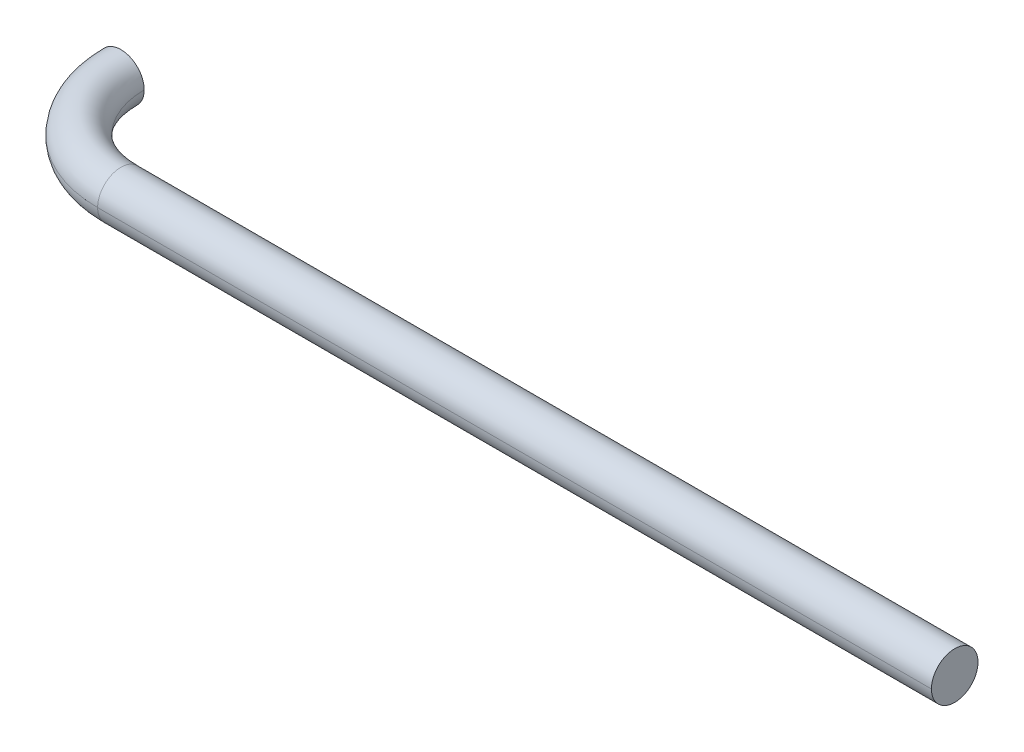
ISO-10303-21;
HEADER;
FILE_DESCRIPTION(('STEP AP214'),'2;1');
FILE_NAME('part.step','',(''),(''),'','','');
FILE_SCHEMA(('AUTOMOTIVE_DESIGN { 1 0 10303 214 1 1 1 1 }'));
ENDSEC;
DATA;
#1=APPLICATION_CONTEXT('core data for automotive mechanical design processes');
#2=APPLICATION_PROTOCOL_DEFINITION('international standard','automotive_design',2000,#1);
#3=PRODUCT_CONTEXT('',#1,'mechanical');
#4=PRODUCT('Part','Part','',(#3));
#5=PRODUCT_RELATED_PRODUCT_CATEGORY('part','',(#4));
#6=PRODUCT_DEFINITION_FORMATION('','',#4);
#7=PRODUCT_DEFINITION_CONTEXT('part definition',#1,'design');
#8=PRODUCT_DEFINITION('design','',#6,#7);
#9=PRODUCT_DEFINITION_SHAPE('','',#8);
#10=(LENGTH_UNIT() NAMED_UNIT(*) SI_UNIT(.MILLI.,.METRE.));
#11=(NAMED_UNIT(*) PLANE_ANGLE_UNIT() SI_UNIT($,.RADIAN.));
#12=(NAMED_UNIT(*) SI_UNIT($,.STERADIAN.) SOLID_ANGLE_UNIT());
#13=UNCERTAINTY_MEASURE_WITH_UNIT(LENGTH_MEASURE(1.E-05),#10,'distance_accuracy_value','');
#14=(GEOMETRIC_REPRESENTATION_CONTEXT(3) GLOBAL_UNCERTAINTY_ASSIGNED_CONTEXT((#13)) GLOBAL_UNIT_ASSIGNED_CONTEXT((#10,
#11,#12)) REPRESENTATION_CONTEXT('',''));
#15=CARTESIAN_POINT('',(0.,0.,0.));
#16=DIRECTION('',(0.,0.,1.));
#17=DIRECTION('',(1.,0.,0.));
#18=AXIS2_PLACEMENT_3D('',#15,#16,#17);
#19=CARTESIAN_POINT('',(3.4999999999986,0.,1.39727442019107E-12));
#20=DIRECTION('',(0.,1.,0.));
#21=DIRECTION('',(-1.,0.,-3.99221262911893E-13));
#22=AXIS2_PLACEMENT_3D('',#19,#20,#21);
#23=TOROIDAL_SURFACE('',#22,3.4999999999986,0.8);
#24=CARTESIAN_POINT('',(3.4999999999986,0.,1.39727442019107E-12));
#25=DIRECTION('',(0.,1.,0.));
#26=DIRECTION('',(0.,0.,1.));
#27=AXIS2_PLACEMENT_3D('',#24,#25,#26);
#28=CIRCLE('',#27,4.2999999999986);
#29=CARTESIAN_POINT('',(-0.8,0.,0.));
#30=VERTEX_POINT('',#29);
#31=CARTESIAN_POINT('',(3.49999999999744,0.,4.3));
#32=VERTEX_POINT('',#31);
#33=EDGE_CURVE('E83',#30,#32,#28,.T.);
#34=ORIENTED_EDGE('',*,*,#33,.F.);
#35=CARTESIAN_POINT('',(0.,0.,0.));
#36=DIRECTION('',(0.,0.,1.));
#37=DIRECTION('',(-1.,0.,0.));
#38=AXIS2_PLACEMENT_3D('',#35,#36,#37);
#39=CIRCLE('',#38,0.8);
#40=CARTESIAN_POINT('',(0.8,0.,0.));
#41=VERTEX_POINT('',#40);
#42=EDGE_CURVE('E28',#30,#41,#39,.T.);
#43=ORIENTED_EDGE('',*,*,#42,.T.);
#44=CARTESIAN_POINT('',(3.4999999999986,0.,1.39727442019107E-12));
#45=DIRECTION('',(0.,1.,0.));
#46=DIRECTION('',(0.,0.,1.));
#47=AXIS2_PLACEMENT_3D('',#44,#45,#46);
#48=CIRCLE('',#47,2.6999999999986);
#49=CARTESIAN_POINT('',(3.49999999999787,0.,2.7));
#50=VERTEX_POINT('',#49);
#51=EDGE_CURVE('E80',#41,#50,#48,.T.);
#52=ORIENTED_EDGE('',*,*,#51,.T.);
#53=CARTESIAN_POINT('',(3.49999999999765,0.,3.5));
#54=DIRECTION('',(1.,0.,2.71592644207619E-13));
#55=DIRECTION('',(-2.71592644207619E-13,0.,1.));
#56=AXIS2_PLACEMENT_3D('',#53,#54,#55);
#57=CIRCLE('',#56,0.8);
#58=EDGE_CURVE('E21',#32,#50,#57,.T.);
#59=ORIENTED_EDGE('',*,*,#58,.F.);
#60=EDGE_LOOP('',(#34,#43,#52,#59));
#61=FACE_BOUND('',#60,.T.);
#62=ADVANCED_FACE('F17',(#61),#23,.T.);
#63=CARTESIAN_POINT('',(3.49999999999765,0.,3.5));
#64=DIRECTION('',(1.,0.,0.));
#65=DIRECTION('',(0.,0.,1.));
#66=AXIS2_PLACEMENT_3D('',#63,#64,#65);
#67=CYLINDRICAL_SURFACE('',#66,0.8);
#68=DIRECTION('',(1.,0.,0.));
#69=VECTOR('',#68,1.);
#70=CARTESIAN_POINT('',(3.49999999999765,0.,2.7));
#71=LINE('',#70,#69);
#72=CARTESIAN_POINT('',(32.1389851691479,0.,2.7));
#73=VERTEX_POINT('',#72);
#74=EDGE_CURVE('E55',#50,#73,#71,.T.);
#75=ORIENTED_EDGE('',*,*,#74,.F.);
#76=CARTESIAN_POINT('',(3.49999999999765,0.,3.5));
#77=DIRECTION('',(1.,0.,2.71592644207619E-13));
#78=DIRECTION('',(-2.71592644207619E-13,0.,1.));
#79=AXIS2_PLACEMENT_3D('',#76,#77,#78);
#80=CIRCLE('',#79,0.8);
#81=EDGE_CURVE('E89',#50,#32,#80,.T.);
#82=ORIENTED_EDGE('',*,*,#81,.T.);
#83=DIRECTION('',(1.,0.,0.));
#84=VECTOR('',#83,1.);
#85=CARTESIAN_POINT('',(3.49999999999765,0.,4.3));
#86=LINE('',#85,#84);
#87=CARTESIAN_POINT('',(32.1389851691481,0.,4.3));
#88=VERTEX_POINT('',#87);
#89=EDGE_CURVE('E64',#32,#88,#86,.T.);
#90=ORIENTED_EDGE('',*,*,#89,.T.);
#91=CARTESIAN_POINT('',(32.138985169148,0.,3.5));
#92=DIRECTION('',(1.,0.,-1.3010426069826E-13));
#93=DIRECTION('',(1.3010426069826E-13,0.,1.));
#94=AXIS2_PLACEMENT_3D('',#91,#92,#93);
#95=CIRCLE('',#94,0.8);
#96=EDGE_CURVE('E11',#73,#88,#95,.T.);
#97=ORIENTED_EDGE('',*,*,#96,.F.);
#98=EDGE_LOOP('',(#75,#82,#90,#97));
#99=FACE_BOUND('',#98,.T.);
#100=ADVANCED_FACE('F115',(#99),#67,.T.);
#101=CARTESIAN_POINT('',(32.138985169148,0.,3.5));
#102=DIRECTION('',(1.,0.,-1.27491950812021E-13));
#103=DIRECTION('',(-1.27491950812021E-13,0.,-1.));
#104=AXIS2_PLACEMENT_3D('',#101,#102,#103);
#105=PLANE('',#104);
#106=CARTESIAN_POINT('',(32.138985169148,0.,3.5));
#107=DIRECTION('',(1.,0.,-1.3010426069826E-13));
#108=DIRECTION('',(1.3010426069826E-13,0.,1.));
#109=AXIS2_PLACEMENT_3D('',#106,#107,#108);
#110=CIRCLE('',#109,0.8);
#111=EDGE_CURVE('E102',#88,#73,#110,.T.);
#112=ORIENTED_EDGE('',*,*,#111,.T.);
#113=ORIENTED_EDGE('',*,*,#96,.T.);
#114=EDGE_LOOP('',(#112,#113));
#115=FACE_BOUND('',#114,.T.);
#116=ADVANCED_FACE('F117',(#115),#105,.T.);
#117=CARTESIAN_POINT('',(0.,0.,0.));
#118=DIRECTION('',(0.,0.,1.));
#119=DIRECTION('',(1.,0.,0.));
#120=AXIS2_PLACEMENT_3D('',#117,#118,#119);
#121=PLANE('',#120);
#122=CARTESIAN_POINT('',(0.,0.,0.));
#123=DIRECTION('',(0.,0.,1.));
#124=DIRECTION('',(-1.,0.,0.));
#125=AXIS2_PLACEMENT_3D('',#122,#123,#124);
#126=CIRCLE('',#125,0.8);
#127=EDGE_CURVE('E88',#41,#30,#126,.T.);
#128=ORIENTED_EDGE('',*,*,#127,.F.);
#129=ORIENTED_EDGE('',*,*,#42,.F.);
#130=EDGE_LOOP('',(#128,#129));
#131=FACE_BOUND('',#130,.T.);
#132=ADVANCED_FACE('F92',(#131),#121,.F.);
#133=CARTESIAN_POINT('',(3.49999999999765,0.,3.5));
#134=DIRECTION('',(1.,0.,0.));
#135=DIRECTION('',(0.,0.,1.));
#136=AXIS2_PLACEMENT_3D('',#133,#134,#135);
#137=CYLINDRICAL_SURFACE('',#136,0.8);
#138=ORIENTED_EDGE('',*,*,#58,.T.);
#139=ORIENTED_EDGE('',*,*,#74,.T.);
#140=ORIENTED_EDGE('',*,*,#111,.F.);
#141=ORIENTED_EDGE('',*,*,#89,.F.);
#142=EDGE_LOOP('',(#138,#139,#140,#141));
#143=FACE_BOUND('',#142,.T.);
#144=ADVANCED_FACE('F19',(#143),#137,.T.);
#145=CARTESIAN_POINT('',(3.4999999999986,0.,1.39727442019107E-12));
#146=DIRECTION('',(0.,1.,0.));
#147=DIRECTION('',(-1.,0.,-3.99221262911893E-13));
#148=AXIS2_PLACEMENT_3D('',#145,#146,#147);
#149=TOROIDAL_SURFACE('',#148,3.4999999999986,0.8);
#150=ORIENTED_EDGE('',*,*,#127,.T.);
#151=ORIENTED_EDGE('',*,*,#33,.T.);
#152=ORIENTED_EDGE('',*,*,#81,.F.);
#153=ORIENTED_EDGE('',*,*,#51,.F.);
#154=EDGE_LOOP('',(#150,#151,#152,#153));
#155=FACE_BOUND('',#154,.T.);
#156=ADVANCED_FACE('F87',(#155),#149,.T.);
#157=CLOSED_SHELL('',(#62,#100,#116,#132,#144,#156));
#158=MANIFOLD_SOLID_BREP('B1',#157);
#159=ADVANCED_BREP_SHAPE_REPRESENTATION('',(#18,#158),#14);
#160=SHAPE_DEFINITION_REPRESENTATION(#9,#159);
ENDSEC;
END-ISO-10303-21;
